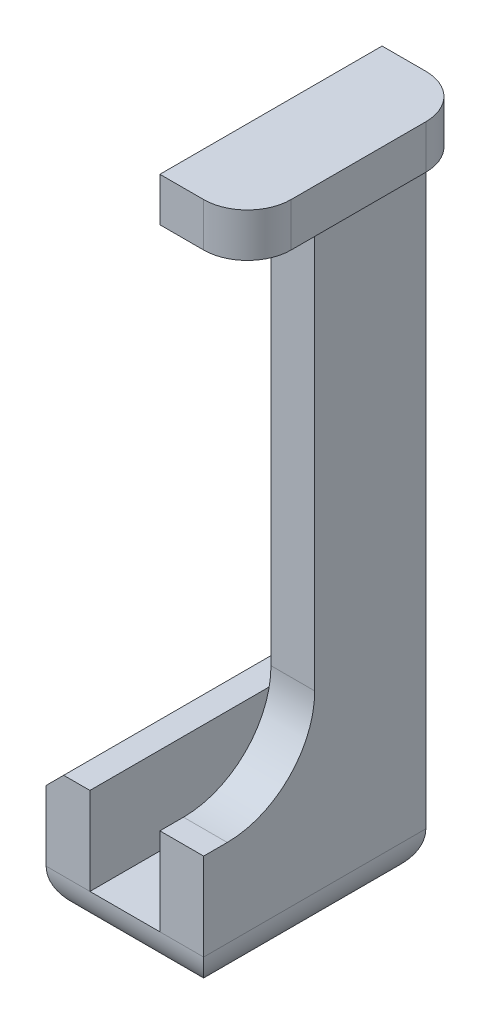
ISO-10303-21;
HEADER;
FILE_DESCRIPTION(('STEP AP214'),'2;1');
FILE_NAME('part.step','',(''),(''),'','','');
FILE_SCHEMA(('AUTOMOTIVE_DESIGN { 1 0 10303 214 1 1 1 1 }'));
ENDSEC;
DATA;
#1=APPLICATION_CONTEXT('core data for automotive mechanical design processes');
#2=APPLICATION_PROTOCOL_DEFINITION('international standard','automotive_design',2000,#1);
#3=PRODUCT_CONTEXT('',#1,'mechanical');
#4=PRODUCT('Part','Part','',(#3));
#5=PRODUCT_RELATED_PRODUCT_CATEGORY('part','',(#4));
#6=PRODUCT_DEFINITION_FORMATION('','',#4);
#7=PRODUCT_DEFINITION_CONTEXT('part definition',#1,'design');
#8=PRODUCT_DEFINITION('design','',#6,#7);
#9=PRODUCT_DEFINITION_SHAPE('','',#8);
#10=(LENGTH_UNIT() NAMED_UNIT(*) SI_UNIT(.MILLI.,.METRE.));
#11=(NAMED_UNIT(*) PLANE_ANGLE_UNIT() SI_UNIT($,.RADIAN.));
#12=(NAMED_UNIT(*) SI_UNIT($,.STERADIAN.) SOLID_ANGLE_UNIT());
#13=UNCERTAINTY_MEASURE_WITH_UNIT(LENGTH_MEASURE(1.E-05),#10,'distance_accuracy_value','');
#14=(GEOMETRIC_REPRESENTATION_CONTEXT(3) GLOBAL_UNCERTAINTY_ASSIGNED_CONTEXT((#13)) GLOBAL_UNIT_ASSIGNED_CONTEXT((#10,
#11,#12)) REPRESENTATION_CONTEXT('',''));
#15=CARTESIAN_POINT('',(0.,0.,0.));
#16=DIRECTION('',(0.,0.,1.));
#17=DIRECTION('',(1.,0.,0.));
#18=AXIS2_PLACEMENT_3D('',#15,#16,#17);
#19=CARTESIAN_POINT('',(0.,0.,0.));
#20=DIRECTION('',(0.,0.,-1.));
#21=DIRECTION('',(-1.,0.,0.));
#22=AXIS2_PLACEMENT_3D('',#19,#20,#21);
#23=PLANE('',#22);
#24=DIRECTION('',(0.,1.,0.));
#25=VECTOR('',#24,1.);
#26=CARTESIAN_POINT('',(5.00000000000002,-5.,0.));
#27=LINE('',#26,#25);
#28=CARTESIAN_POINT('',(5.00000000000002,0.,0.));
#29=VERTEX_POINT('',#28);
#30=CARTESIAN_POINT('',(5.00000000000001,70.,0.));
#31=VERTEX_POINT('',#30);
#32=EDGE_CURVE('E237',#29,#31,#27,.T.);
#33=ORIENTED_EDGE('',*,*,#32,.F.);
#34=DIRECTION('',(1.,0.,0.));
#35=VECTOR('',#34,1.);
#36=CARTESIAN_POINT('',(-13.,0.,0.));
#37=LINE('',#36,#35);
#38=CARTESIAN_POINT('',(0.,0.,0.));
#39=VERTEX_POINT('',#38);
#40=EDGE_CURVE('E290',#29,#39,#37,.F.);
#41=ORIENTED_EDGE('',*,*,#40,.T.);
#42=DIRECTION('',(0.,-1.,0.));
#43=VECTOR('',#42,1.);
#44=CARTESIAN_POINT('',(0.,75.,0.));
#45=LINE('',#44,#43);
#46=CARTESIAN_POINT('',(0.,75.,0.));
#47=VERTEX_POINT('',#46);
#48=EDGE_CURVE('E223',#47,#39,#45,.T.);
#49=ORIENTED_EDGE('',*,*,#48,.F.);
#50=DIRECTION('',(-1.,0.,0.));
#51=VECTOR('',#50,1.);
#52=CARTESIAN_POINT('',(10.,75.,0.));
#53=LINE('',#52,#51);
#54=CARTESIAN_POINT('',(5.00000000000001,75.,0.));
#55=VERTEX_POINT('',#54);
#56=EDGE_CURVE('E185',#55,#47,#53,.T.);
#57=ORIENTED_EDGE('',*,*,#56,.F.);
#58=DIRECTION('',(0.,1.,0.));
#59=VECTOR('',#58,1.);
#60=CARTESIAN_POINT('',(5.00000000000001,70.,0.));
#61=LINE('',#60,#59);
#62=EDGE_CURVE('E285',#55,#31,#61,.F.);
#63=ORIENTED_EDGE('',*,*,#62,.T.);
#64=EDGE_LOOP('',(#33,#41,#49,#57,#63));
#65=FACE_BOUND('',#64,.T.);
#66=ADVANCED_FACE('F33',(#65),#23,.T.);
#67=CARTESIAN_POINT('',(0.,0.,25.4));
#68=DIRECTION('',(0.,0.,1.));
#69=DIRECTION('',(1.,0.,0.));
#70=AXIS2_PLACEMENT_3D('',#67,#68,#69);
#71=PLANE('',#70);
#72=DIRECTION('',(-1.,0.,0.));
#73=VECTOR('',#72,1.);
#74=CARTESIAN_POINT('',(0.,9.99999999999999,25.4));
#75=LINE('',#74,#73);
#76=CARTESIAN_POINT('',(-8.,10.,25.4));
#77=VERTEX_POINT('',#76);
#78=CARTESIAN_POINT('',(-11.,10.,25.4));
#79=VERTEX_POINT('',#78);
#80=EDGE_CURVE('E211',#77,#79,#75,.T.);
#81=ORIENTED_EDGE('',*,*,#80,.T.);
#82=DIRECTION('',(0.70710678118655,0.707106781186545,0.));
#83=VECTOR('',#82,1.);
#84=CARTESIAN_POINT('',(-10.5,10.5,25.4));
#85=LINE('',#84,#83);
#86=CARTESIAN_POINT('',(-13.,8.,25.4));
#87=VERTEX_POINT('',#86);
#88=EDGE_CURVE('E11',#79,#87,#85,.F.);
#89=ORIENTED_EDGE('',*,*,#88,.T.);
#90=DIRECTION('',(0.,-1.,0.));
#91=VECTOR('',#90,1.);
#92=CARTESIAN_POINT('',(-13.,0.,25.4));
#93=LINE('',#92,#91);
#94=CARTESIAN_POINT('',(-13.,0.,25.4));
#95=VERTEX_POINT('',#94);
#96=EDGE_CURVE('E213',#87,#95,#93,.T.);
#97=ORIENTED_EDGE('',*,*,#96,.T.);
#98=DIRECTION('',(1.,0.,0.));
#99=VECTOR('',#98,1.);
#100=CARTESIAN_POINT('',(5.00000000000002,0.,25.4));
#101=LINE('',#100,#99);
#102=CARTESIAN_POINT('',(-8.,0.,25.4));
#103=VERTEX_POINT('',#102);
#104=EDGE_CURVE('E281',#95,#103,#101,.T.);
#105=ORIENTED_EDGE('',*,*,#104,.T.);
#106=DIRECTION('',(0.,1.,0.));
#107=VECTOR('',#106,1.);
#108=CARTESIAN_POINT('',(-8.,0.,25.4));
#109=LINE('',#108,#107);
#110=EDGE_CURVE('E208',#103,#77,#109,.T.);
#111=ORIENTED_EDGE('',*,*,#110,.T.);
#112=EDGE_LOOP('',(#81,#89,#97,#105,#111));
#113=FACE_BOUND('',#112,.T.);
#114=ADVANCED_FACE('F363',(#113),#71,.T.);
#115=CARTESIAN_POINT('',(0.,75.,12.7));
#116=DIRECTION('',(1.,0.,0.));
#117=DIRECTION('',(0.,1.,0.));
#118=AXIS2_PLACEMENT_3D('',#115,#116,#117);
#119=PLANE('',#118);
#120=ORIENTED_EDGE('',*,*,#48,.T.);
#121=DIRECTION('',(0.,0.,-1.));
#122=VECTOR('',#121,1.);
#123=CARTESIAN_POINT('',(0.,0.,12.7));
#124=LINE('',#123,#122);
#125=CARTESIAN_POINT('',(0.,0.,25.4));
#126=VERTEX_POINT('',#125);
#127=EDGE_CURVE('E254',#126,#39,#124,.T.);
#128=ORIENTED_EDGE('',*,*,#127,.F.);
#129=DIRECTION('',(0.,-1.,0.));
#130=VECTOR('',#129,1.);
#131=CARTESIAN_POINT('',(0.,0.,25.4));
#132=LINE('',#131,#130);
#133=CARTESIAN_POINT('',(0.,10.,25.4));
#134=VERTEX_POINT('',#133);
#135=EDGE_CURVE('E202',#134,#126,#132,.T.);
#136=ORIENTED_EDGE('',*,*,#135,.F.);
#137=DIRECTION('',(0.,0.,-1.));
#138=VECTOR('',#137,1.);
#139=CARTESIAN_POINT('',(0.,10.,25.4));
#140=LINE('',#139,#138);
#141=CARTESIAN_POINT('',(0.,10.,22.7));
#142=VERTEX_POINT('',#141);
#143=EDGE_CURVE('E220',#134,#142,#140,.T.);
#144=ORIENTED_EDGE('',*,*,#143,.T.);
#145=CARTESIAN_POINT('',(0.,20.,22.7));
#146=DIRECTION('',(1.,0.,0.));
#147=DIRECTION('',(0.,1.,0.));
#148=AXIS2_PLACEMENT_3D('',#145,#146,#147);
#149=CIRCLE('',#148,10.);
#150=CARTESIAN_POINT('',(0.,20.,12.7));
#151=VERTEX_POINT('',#150);
#152=EDGE_CURVE('E264',#142,#151,#149,.T.);
#153=ORIENTED_EDGE('',*,*,#152,.T.);
#154=DIRECTION('',(0.,-1.,0.));
#155=VECTOR('',#154,1.);
#156=CARTESIAN_POINT('',(0.,75.,12.7));
#157=LINE('',#156,#155);
#158=CARTESIAN_POINT('',(0.,65.,12.7));
#159=VERTEX_POINT('',#158);
#160=EDGE_CURVE('E224',#159,#151,#157,.T.);
#161=ORIENTED_EDGE('',*,*,#160,.F.);
#162=CARTESIAN_POINT('',(0.,65.,17.7));
#163=DIRECTION('',(1.,0.,0.));
#164=DIRECTION('',(0.,1.,0.));
#165=AXIS2_PLACEMENT_3D('',#162,#163,#164);
#166=CIRCLE('',#165,5.);
#167=CARTESIAN_POINT('',(0.,70.,17.7));
#168=VERTEX_POINT('',#167);
#169=EDGE_CURVE('E312',#159,#168,#166,.T.);
#170=ORIENTED_EDGE('',*,*,#169,.T.);
#171=DIRECTION('',(0.,0.,-1.));
#172=VECTOR('',#171,1.);
#173=CARTESIAN_POINT('',(0.,70.,25.4));
#174=LINE('',#173,#172);
#175=CARTESIAN_POINT('',(0.,70.,25.4));
#176=VERTEX_POINT('',#175);
#177=EDGE_CURVE('E194',#176,#168,#174,.T.);
#178=ORIENTED_EDGE('',*,*,#177,.F.);
#179=DIRECTION('',(0.,-1.,0.));
#180=VECTOR('',#179,1.);
#181=CARTESIAN_POINT('',(0.,0.,25.4));
#182=LINE('',#181,#180);
#183=CARTESIAN_POINT('',(0.,75.,25.4));
#184=VERTEX_POINT('',#183);
#185=EDGE_CURVE('E173',#184,#176,#182,.T.);
#186=ORIENTED_EDGE('',*,*,#185,.F.);
#187=DIRECTION('',(0.,0.,-1.));
#188=VECTOR('',#187,1.);
#189=CARTESIAN_POINT('',(0.,75.,12.7));
#190=LINE('',#189,#188);
#191=EDGE_CURVE('E181',#184,#47,#190,.T.);
#192=ORIENTED_EDGE('',*,*,#191,.T.);
#193=EDGE_LOOP('',(#120,#128,#136,#144,#153,#161,#170,#178,#186,#192));
#194=FACE_BOUND('',#193,.T.);
#195=ADVANCED_FACE('F192',(#194),#119,.F.);
#196=CARTESIAN_POINT('',(0.,0.,12.7));
#197=DIRECTION('',(0.,-1.,0.));
#198=DIRECTION('',(0.,0.,-1.));
#199=AXIS2_PLACEMENT_3D('',#196,#197,#198);
#200=PLANE('',#199);
#201=DIRECTION('',(-1.,0.,0.));
#202=VECTOR('',#201,1.);
#203=CARTESIAN_POINT('',(0.,0.,0.));
#204=LINE('',#203,#202);
#205=CARTESIAN_POINT('',(-8.,0.,0.));
#206=VERTEX_POINT('',#205);
#207=EDGE_CURVE('E229',#39,#206,#204,.T.);
#208=ORIENTED_EDGE('',*,*,#207,.T.);
#209=DIRECTION('',(0.,0.,-1.));
#210=VECTOR('',#209,1.);
#211=CARTESIAN_POINT('',(-8.,0.,12.7));
#212=LINE('',#211,#210);
#213=EDGE_CURVE('E251',#103,#206,#212,.T.);
#214=ORIENTED_EDGE('',*,*,#213,.F.);
#215=DIRECTION('',(-1.,0.,0.));
#216=VECTOR('',#215,1.);
#217=CARTESIAN_POINT('',(0.,0.,25.4));
#218=LINE('',#217,#216);
#219=EDGE_CURVE('E205',#126,#103,#218,.T.);
#220=ORIENTED_EDGE('',*,*,#219,.F.);
#221=ORIENTED_EDGE('',*,*,#127,.T.);
#222=EDGE_LOOP('',(#208,#214,#220,#221));
#223=FACE_BOUND('',#222,.T.);
#224=ADVANCED_FACE('F366',(#223),#200,.F.);
#225=CARTESIAN_POINT('',(-8.,0.,12.7));
#226=DIRECTION('',(-1.,0.,0.));
#227=DIRECTION('',(0.,0.,1.));
#228=AXIS2_PLACEMENT_3D('',#225,#226,#227);
#229=PLANE('',#228);
#230=DIRECTION('',(0.,1.,0.));
#231=VECTOR('',#230,1.);
#232=CARTESIAN_POINT('',(-8.,0.,0.));
#233=LINE('',#232,#231);
#234=CARTESIAN_POINT('',(-8.,10.,0.));
#235=VERTEX_POINT('',#234);
#236=EDGE_CURVE('E231',#206,#235,#233,.T.);
#237=ORIENTED_EDGE('',*,*,#236,.T.);
#238=DIRECTION('',(0.,0.,-1.));
#239=VECTOR('',#238,1.);
#240=CARTESIAN_POINT('',(-8.,10.,12.7));
#241=LINE('',#240,#239);
#242=EDGE_CURVE('E248',#77,#235,#241,.T.);
#243=ORIENTED_EDGE('',*,*,#242,.F.);
#244=ORIENTED_EDGE('',*,*,#110,.F.);
#245=ORIENTED_EDGE('',*,*,#213,.T.);
#246=EDGE_LOOP('',(#237,#243,#244,#245));
#247=FACE_BOUND('',#246,.T.);
#248=ADVANCED_FACE('F368',(#247),#229,.F.);
#249=CARTESIAN_POINT('',(-8.,10.,12.7));
#250=DIRECTION('',(0.,-1.,0.));
#251=DIRECTION('',(1.,0.,0.));
#252=AXIS2_PLACEMENT_3D('',#249,#250,#251);
#253=PLANE('',#252);
#254=DIRECTION('',(-1.,0.,0.));
#255=VECTOR('',#254,1.);
#256=CARTESIAN_POINT('',(-8.,10.,0.));
#257=LINE('',#256,#255);
#258=CARTESIAN_POINT('',(-11.,10.,0.));
#259=VERTEX_POINT('',#258);
#260=EDGE_CURVE('E233',#235,#259,#257,.T.);
#261=ORIENTED_EDGE('',*,*,#260,.T.);
#262=DIRECTION('',(0.,0.,1.));
#263=VECTOR('',#262,1.);
#264=CARTESIAN_POINT('',(-11.,10.,12.7));
#265=LINE('',#264,#263);
#266=EDGE_CURVE('E41',#259,#79,#265,.T.);
#267=ORIENTED_EDGE('',*,*,#266,.T.);
#268=ORIENTED_EDGE('',*,*,#80,.F.);
#269=ORIENTED_EDGE('',*,*,#242,.T.);
#270=EDGE_LOOP('',(#261,#267,#268,#269));
#271=FACE_BOUND('',#270,.T.);
#272=ADVANCED_FACE('F369',(#271),#253,.F.);
#273=CARTESIAN_POINT('',(-13.,10.,12.7));
#274=DIRECTION('',(1.,0.,0.));
#275=DIRECTION('',(0.,1.,0.));
#276=AXIS2_PLACEMENT_3D('',#273,#274,#275);
#277=PLANE('',#276);
#278=ORIENTED_EDGE('',*,*,#96,.F.);
#279=DIRECTION('',(0.,0.,-1.));
#280=VECTOR('',#279,1.);
#281=CARTESIAN_POINT('',(-13.,8.,12.7));
#282=LINE('',#281,#280);
#283=CARTESIAN_POINT('',(-13.,8.,0.));
#284=VERTEX_POINT('',#283);
#285=EDGE_CURVE('E316',#87,#284,#282,.T.);
#286=ORIENTED_EDGE('',*,*,#285,.T.);
#287=DIRECTION('',(0.,-1.,0.));
#288=VECTOR('',#287,1.);
#289=CARTESIAN_POINT('',(-13.,10.,0.));
#290=LINE('',#289,#288);
#291=CARTESIAN_POINT('',(-13.,0.,0.));
#292=VERTEX_POINT('',#291);
#293=EDGE_CURVE('E235',#284,#292,#290,.T.);
#294=ORIENTED_EDGE('',*,*,#293,.T.);
#295=DIRECTION('',(0.,0.,-1.));
#296=VECTOR('',#295,1.);
#297=CARTESIAN_POINT('',(-13.,0.,12.7));
#298=LINE('',#297,#296);
#299=EDGE_CURVE('E276',#292,#95,#298,.F.);
#300=ORIENTED_EDGE('',*,*,#299,.T.);
#301=EDGE_LOOP('',(#278,#286,#294,#300));
#302=FACE_BOUND('',#301,.T.);
#303=ADVANCED_FACE('F333',(#302),#277,.F.);
#304=CARTESIAN_POINT('',(-13.,-5.,12.7));
#305=DIRECTION('',(0.,1.,0.));
#306=DIRECTION('',(-1.,0.,0.));
#307=AXIS2_PLACEMENT_3D('',#304,#305,#306);
#308=PLANE('',#307);
#309=DIRECTION('',(1.,0.,0.));
#310=VECTOR('',#309,1.);
#311=CARTESIAN_POINT('',(-13.,-5.,20.4));
#312=LINE('',#311,#310);
#313=CARTESIAN_POINT('',(0.,-5.,20.4));
#314=VERTEX_POINT('',#313);
#315=CARTESIAN_POINT('',(-8.,-5.,20.4));
#316=VERTEX_POINT('',#315);
#317=EDGE_CURVE('E271',#314,#316,#312,.F.);
#318=ORIENTED_EDGE('',*,*,#317,.T.);
#319=DIRECTION('',(0.,0.,-1.));
#320=VECTOR('',#319,1.);
#321=CARTESIAN_POINT('',(-8.,-5.,12.7));
#322=LINE('',#321,#320);
#323=CARTESIAN_POINT('',(-8.,-5.,5.));
#324=VERTEX_POINT('',#323);
#325=EDGE_CURVE('E273',#316,#324,#322,.T.);
#326=ORIENTED_EDGE('',*,*,#325,.T.);
#327=DIRECTION('',(1.,0.,0.));
#328=VECTOR('',#327,1.);
#329=CARTESIAN_POINT('',(5.00000000000002,-5.,5.));
#330=LINE('',#329,#328);
#331=CARTESIAN_POINT('',(0.,-5.,5.));
#332=VERTEX_POINT('',#331);
#333=EDGE_CURVE('E267',#324,#332,#330,.T.);
#334=ORIENTED_EDGE('',*,*,#333,.T.);
#335=DIRECTION('',(0.,0.,-1.));
#336=VECTOR('',#335,1.);
#337=CARTESIAN_POINT('',(0.,-5.,12.7));
#338=LINE('',#337,#336);
#339=EDGE_CURVE('E269',#332,#314,#338,.F.);
#340=ORIENTED_EDGE('',*,*,#339,.T.);
#341=EDGE_LOOP('',(#318,#326,#334,#340));
#342=FACE_BOUND('',#341,.T.);
#343=ADVANCED_FACE('F354',(#342),#308,.F.);
#344=CARTESIAN_POINT('',(5.00000000000002,-5.,12.7));
#345=DIRECTION('',(-1.,0.,0.));
#346=DIRECTION('',(0.,-1.,0.));
#347=AXIS2_PLACEMENT_3D('',#344,#345,#346);
#348=PLANE('',#347);
#349=DIRECTION('',(0.,1.,0.));
#350=VECTOR('',#349,1.);
#351=CARTESIAN_POINT('',(5.00000000000002,0.,25.4));
#352=LINE('',#351,#350);
#353=CARTESIAN_POINT('',(5.00000000000002,0.,25.4));
#354=VERTEX_POINT('',#353);
#355=CARTESIAN_POINT('',(5.00000000000002,10.,25.4));
#356=VERTEX_POINT('',#355);
#357=EDGE_CURVE('E215',#354,#356,#352,.T.);
#358=ORIENTED_EDGE('',*,*,#357,.F.);
#359=DIRECTION('',(0.,0.,-1.));
#360=VECTOR('',#359,1.);
#361=CARTESIAN_POINT('',(5.00000000000002,0.,12.7));
#362=LINE('',#361,#360);
#363=EDGE_CURVE('E283',#354,#29,#362,.T.);
#364=ORIENTED_EDGE('',*,*,#363,.T.);
#365=ORIENTED_EDGE('',*,*,#32,.T.);
#366=DIRECTION('',(0.,0.,-1.));
#367=VECTOR('',#366,1.);
#368=CARTESIAN_POINT('',(5.00000000000001,70.,12.7));
#369=LINE('',#368,#367);
#370=CARTESIAN_POINT('',(5.00000000000001,70.,17.7));
#371=VERTEX_POINT('',#370);
#372=EDGE_CURVE('E245',#371,#31,#369,.T.);
#373=ORIENTED_EDGE('',*,*,#372,.F.);
#374=CARTESIAN_POINT('',(5.00000000000001,65.,17.7));
#375=DIRECTION('',(-1.,0.,0.));
#376=DIRECTION('',(0.,-1.,0.));
#377=AXIS2_PLACEMENT_3D('',#374,#375,#376);
#378=CIRCLE('',#377,5.);
#379=CARTESIAN_POINT('',(5.00000000000001,65.,12.7));
#380=VERTEX_POINT('',#379);
#381=EDGE_CURVE('E314',#371,#380,#378,.T.);
#382=ORIENTED_EDGE('',*,*,#381,.T.);
#383=DIRECTION('',(0.,1.,0.));
#384=VECTOR('',#383,1.);
#385=CARTESIAN_POINT('',(5.00000000000002,-5.,12.7));
#386=LINE('',#385,#384);
#387=CARTESIAN_POINT('',(5.00000000000001,20.,12.7));
#388=VERTEX_POINT('',#387);
#389=EDGE_CURVE('E190',#388,#380,#386,.T.);
#390=ORIENTED_EDGE('',*,*,#389,.F.);
#391=CARTESIAN_POINT('',(5.00000000000001,20.,22.7));
#392=DIRECTION('',(-1.,0.,0.));
#393=DIRECTION('',(0.,-1.,0.));
#394=AXIS2_PLACEMENT_3D('',#391,#392,#393);
#395=CIRCLE('',#394,10.);
#396=CARTESIAN_POINT('',(5.00000000000002,10.,22.7));
#397=VERTEX_POINT('',#396);
#398=EDGE_CURVE('E262',#388,#397,#395,.T.);
#399=ORIENTED_EDGE('',*,*,#398,.T.);
#400=DIRECTION('',(0.,0.,-1.));
#401=VECTOR('',#400,1.);
#402=CARTESIAN_POINT('',(5.00000000000002,10.,25.4));
#403=LINE('',#402,#401);
#404=EDGE_CURVE('E217',#356,#397,#403,.T.);
#405=ORIENTED_EDGE('',*,*,#404,.F.);
#406=EDGE_LOOP('',(#358,#364,#365,#373,#382,#390,#399,#405));
#407=FACE_BOUND('',#406,.T.);
#408=ADVANCED_FACE('F456',(#407),#348,.F.);
#409=CARTESIAN_POINT('',(5.00000000000001,70.,12.7));
#410=DIRECTION('',(0.,1.,0.));
#411=DIRECTION('',(0.,0.,1.));
#412=AXIS2_PLACEMENT_3D('',#409,#410,#411);
#413=PLANE('',#412);
#414=ORIENTED_EDGE('',*,*,#372,.T.);
#415=CARTESIAN_POINT('',(5.00000000000001,70.,5.));
#416=DIRECTION('',(0.,1.,0.));
#417=DIRECTION('',(0.,0.,1.));
#418=AXIS2_PLACEMENT_3D('',#415,#416,#417);
#419=CIRCLE('',#418,5.);
#420=CARTESIAN_POINT('',(10.,70.,5.));
#421=VERTEX_POINT('',#420);
#422=EDGE_CURVE('E306',#31,#421,#419,.F.);
#423=ORIENTED_EDGE('',*,*,#422,.T.);
#424=DIRECTION('',(0.,0.,-1.));
#425=VECTOR('',#424,1.);
#426=CARTESIAN_POINT('',(10.,70.,12.7));
#427=LINE('',#426,#425);
#428=CARTESIAN_POINT('',(10.,70.,20.4));
#429=VERTEX_POINT('',#428);
#430=EDGE_CURVE('E242',#429,#421,#427,.T.);
#431=ORIENTED_EDGE('',*,*,#430,.F.);
#432=CARTESIAN_POINT('',(5.00000000000001,70.,20.4));
#433=DIRECTION('',(0.,1.,0.));
#434=DIRECTION('',(0.,0.,1.));
#435=AXIS2_PLACEMENT_3D('',#432,#433,#434);
#436=CIRCLE('',#435,5.);
#437=CARTESIAN_POINT('',(5.00000000000001,70.,25.4));
#438=VERTEX_POINT('',#437);
#439=EDGE_CURVE('E304',#429,#438,#436,.F.);
#440=ORIENTED_EDGE('',*,*,#439,.T.);
#441=DIRECTION('',(-1.,0.,0.));
#442=VECTOR('',#441,1.);
#443=CARTESIAN_POINT('',(0.,70.,25.4));
#444=LINE('',#443,#442);
#445=EDGE_CURVE('E178',#438,#176,#444,.T.);
#446=ORIENTED_EDGE('',*,*,#445,.T.);
#447=ORIENTED_EDGE('',*,*,#177,.T.);
#448=DIRECTION('',(-1.,0.,0.));
#449=VECTOR('',#448,1.);
#450=CARTESIAN_POINT('',(5.00000000000001,70.,17.7));
#451=LINE('',#450,#449);
#452=EDGE_CURVE('E301',#168,#371,#451,.F.);
#453=ORIENTED_EDGE('',*,*,#452,.T.);
#454=EDGE_LOOP('',(#414,#423,#431,#440,#446,#447,#453));
#455=FACE_BOUND('',#454,.T.);
#456=ADVANCED_FACE('F440',(#455),#413,.F.);
#457=CARTESIAN_POINT('',(10.,70.,12.7));
#458=DIRECTION('',(-1.,0.,0.));
#459=DIRECTION('',(0.,0.,1.));
#460=AXIS2_PLACEMENT_3D('',#457,#458,#459);
#461=PLANE('',#460);
#462=ORIENTED_EDGE('',*,*,#430,.T.);
#463=DIRECTION('',(0.,1.,0.));
#464=VECTOR('',#463,1.);
#465=CARTESIAN_POINT('',(10.,75.,5.));
#466=LINE('',#465,#464);
#467=CARTESIAN_POINT('',(10.,75.,5.));
#468=VERTEX_POINT('',#467);
#469=EDGE_CURVE('E294',#421,#468,#466,.T.);
#470=ORIENTED_EDGE('',*,*,#469,.T.);
#471=DIRECTION('',(0.,0.,-1.));
#472=VECTOR('',#471,1.);
#473=CARTESIAN_POINT('',(10.,75.,12.7));
#474=LINE('',#473,#472);
#475=CARTESIAN_POINT('',(10.,75.,20.4));
#476=VERTEX_POINT('',#475);
#477=EDGE_CURVE('E189',#476,#468,#474,.T.);
#478=ORIENTED_EDGE('',*,*,#477,.F.);
#479=DIRECTION('',(0.,1.,0.));
#480=VECTOR('',#479,1.);
#481=CARTESIAN_POINT('',(10.,70.,20.4));
#482=LINE('',#481,#480);
#483=EDGE_CURVE('E292',#476,#429,#482,.F.);
#484=ORIENTED_EDGE('',*,*,#483,.T.);
#485=EDGE_LOOP('',(#462,#470,#478,#484));
#486=FACE_BOUND('',#485,.T.);
#487=ADVANCED_FACE('F401',(#486),#461,.F.);
#488=CARTESIAN_POINT('',(10.,75.,12.7));
#489=DIRECTION('',(0.,-1.,0.));
#490=DIRECTION('',(0.,0.,-1.));
#491=AXIS2_PLACEMENT_3D('',#488,#489,#490);
#492=PLANE('',#491);
#493=ORIENTED_EDGE('',*,*,#477,.T.);
#494=CARTESIAN_POINT('',(5.00000000000001,75.,5.));
#495=DIRECTION('',(0.,-1.,0.));
#496=DIRECTION('',(0.,0.,-1.));
#497=AXIS2_PLACEMENT_3D('',#494,#495,#496);
#498=CIRCLE('',#497,5.);
#499=EDGE_CURVE('E299',#468,#55,#498,.F.);
#500=ORIENTED_EDGE('',*,*,#499,.T.);
#501=ORIENTED_EDGE('',*,*,#56,.T.);
#502=ORIENTED_EDGE('',*,*,#191,.F.);
#503=DIRECTION('',(-1.,0.,0.));
#504=VECTOR('',#503,1.);
#505=CARTESIAN_POINT('',(0.,75.,25.4));
#506=LINE('',#505,#504);
#507=CARTESIAN_POINT('',(5.00000000000001,75.,25.4));
#508=VERTEX_POINT('',#507);
#509=EDGE_CURVE('E168',#508,#184,#506,.T.);
#510=ORIENTED_EDGE('',*,*,#509,.F.);
#511=CARTESIAN_POINT('',(5.00000000000001,75.,20.4));
#512=DIRECTION('',(0.,-1.,0.));
#513=DIRECTION('',(0.,0.,-1.));
#514=AXIS2_PLACEMENT_3D('',#511,#512,#513);
#515=CIRCLE('',#514,5.);
#516=EDGE_CURVE('E297',#508,#476,#515,.F.);
#517=ORIENTED_EDGE('',*,*,#516,.T.);
#518=EDGE_LOOP('',(#493,#500,#501,#502,#510,#517));
#519=FACE_BOUND('',#518,.T.);
#520=ADVANCED_FACE('F183',(#519),#492,.F.);
#521=CARTESIAN_POINT('',(0.,0.,12.7));
#522=DIRECTION('',(0.,0.,-1.));
#523=DIRECTION('',(-1.,0.,0.));
#524=AXIS2_PLACEMENT_3D('',#521,#522,#523);
#525=PLANE('',#524);
#526=ORIENTED_EDGE('',*,*,#389,.T.);
#527=DIRECTION('',(-1.,0.,0.));
#528=VECTOR('',#527,1.);
#529=CARTESIAN_POINT('',(0.,65.,12.7));
#530=LINE('',#529,#528);
#531=EDGE_CURVE('E309',#380,#159,#530,.T.);
#532=ORIENTED_EDGE('',*,*,#531,.T.);
#533=ORIENTED_EDGE('',*,*,#160,.T.);
#534=DIRECTION('',(1.,0.,0.));
#535=VECTOR('',#534,1.);
#536=CARTESIAN_POINT('',(0.,20.,12.7));
#537=LINE('',#536,#535);
#538=EDGE_CURVE('E257',#151,#388,#537,.T.);
#539=ORIENTED_EDGE('',*,*,#538,.T.);
#540=EDGE_LOOP('',(#526,#532,#533,#539));
#541=FACE_BOUND('',#540,.T.);
#542=ADVANCED_FACE('F390',(#541),#525,.F.);
#543=ORIENTED_EDGE('',*,*,#293,.F.);
#544=DIRECTION('',(-0.70710678118655,-0.707106781186545,0.));
#545=VECTOR('',#544,1.);
#546=CARTESIAN_POINT('',(-10.5,10.5,0.));
#547=LINE('',#546,#545);
#548=EDGE_CURVE('E55',#284,#259,#547,.F.);
#549=ORIENTED_EDGE('',*,*,#548,.T.);
#550=ORIENTED_EDGE('',*,*,#260,.F.);
#551=ORIENTED_EDGE('',*,*,#236,.F.);
#552=DIRECTION('',(1.,0.,0.));
#553=VECTOR('',#552,1.);
#554=CARTESIAN_POINT('',(-13.,0.,0.));
#555=LINE('',#554,#553);
#556=EDGE_CURVE('E287',#206,#292,#555,.F.);
#557=ORIENTED_EDGE('',*,*,#556,.T.);
#558=EDGE_LOOP('',(#543,#549,#550,#551,#557));
#559=FACE_BOUND('',#558,.T.);
#560=ADVANCED_FACE('F336',(#559),#23,.T.);
#561=CARTESIAN_POINT('',(0.,10.,25.4));
#562=DIRECTION('',(0.,1.,0.));
#563=DIRECTION('',(-1.,0.,0.));
#564=AXIS2_PLACEMENT_3D('',#561,#562,#563);
#565=PLANE('',#564);
#566=ORIENTED_EDGE('',*,*,#404,.T.);
#567=DIRECTION('',(1.,0.,0.));
#568=VECTOR('',#567,1.);
#569=CARTESIAN_POINT('',(0.,10.,22.7));
#570=LINE('',#569,#568);
#571=EDGE_CURVE('E260',#397,#142,#570,.F.);
#572=ORIENTED_EDGE('',*,*,#571,.T.);
#573=ORIENTED_EDGE('',*,*,#143,.F.);
#574=DIRECTION('',(1.,0.,0.));
#575=VECTOR('',#574,1.);
#576=CARTESIAN_POINT('',(0.,10.,25.4));
#577=LINE('',#576,#575);
#578=EDGE_CURVE('E196',#134,#356,#577,.T.);
#579=ORIENTED_EDGE('',*,*,#578,.T.);
#580=EDGE_LOOP('',(#566,#572,#573,#579));
#581=FACE_BOUND('',#580,.T.);
#582=ADVANCED_FACE('F389',(#581),#565,.T.);
#583=ORIENTED_EDGE('',*,*,#135,.T.);
#584=DIRECTION('',(1.,0.,0.));
#585=VECTOR('',#584,1.);
#586=CARTESIAN_POINT('',(5.00000000000002,0.,25.4));
#587=LINE('',#586,#585);
#588=EDGE_CURVE('E279',#126,#354,#587,.T.);
#589=ORIENTED_EDGE('',*,*,#588,.T.);
#590=ORIENTED_EDGE('',*,*,#357,.T.);
#591=ORIENTED_EDGE('',*,*,#578,.F.);
#592=EDGE_LOOP('',(#583,#589,#590,#591));
#593=FACE_BOUND('',#592,.T.);
#594=ADVANCED_FACE('F384',(#593),#71,.T.);
#595=CARTESIAN_POINT('',(0.,0.,25.4));
#596=DIRECTION('',(0.,0.,1.));
#597=DIRECTION('',(1.,0.,0.));
#598=AXIS2_PLACEMENT_3D('',#595,#596,#597);
#599=PLANE('',#598);
#600=ORIENTED_EDGE('',*,*,#445,.F.);
#601=DIRECTION('',(0.,1.,0.));
#602=VECTOR('',#601,1.);
#603=CARTESIAN_POINT('',(5.00000000000001,75.,25.4));
#604=LINE('',#603,#602);
#605=EDGE_CURVE('E176',#438,#508,#604,.T.);
#606=ORIENTED_EDGE('',*,*,#605,.T.);
#607=ORIENTED_EDGE('',*,*,#509,.T.);
#608=ORIENTED_EDGE('',*,*,#185,.T.);
#609=EDGE_LOOP('',(#600,#606,#607,#608));
#610=FACE_BOUND('',#609,.T.);
#611=ADVANCED_FACE('F171',(#610),#599,.T.);
#612=CARTESIAN_POINT('',(0.,20.,22.7));
#613=DIRECTION('',(1.,0.,0.));
#614=DIRECTION('',(0.,1.,0.));
#615=AXIS2_PLACEMENT_3D('',#612,#613,#614);
#616=CYLINDRICAL_SURFACE('',#615,10.);
#617=ORIENTED_EDGE('',*,*,#152,.F.);
#618=ORIENTED_EDGE('',*,*,#571,.F.);
#619=ORIENTED_EDGE('',*,*,#398,.F.);
#620=ORIENTED_EDGE('',*,*,#538,.F.);
#621=EDGE_LOOP('',(#617,#618,#619,#620));
#622=FACE_BOUND('',#621,.T.);
#623=ADVANCED_FACE('F406',(#622),#616,.F.);
#624=CARTESIAN_POINT('',(0.,0.,12.7));
#625=DIRECTION('',(0.,0.,-1.));
#626=DIRECTION('',(-1.,0.,0.));
#627=AXIS2_PLACEMENT_3D('',#624,#625,#626);
#628=CYLINDRICAL_SURFACE('',#627,5.);
#629=CARTESIAN_POINT('',(0.,0.,5.));
#630=DIRECTION('',(-0.707106781186547,0.,-0.707106781186547));
#631=DIRECTION('',(-0.707106781186547,0.,0.707106781186547));
#632=AXIS2_PLACEMENT_3D('',#629,#630,#631);
#633=ELLIPSE('',#632,7.07106781186547,5.);
#634=EDGE_CURVE('E322',#29,#332,#633,.T.);
#635=ORIENTED_EDGE('',*,*,#634,.F.);
#636=ORIENTED_EDGE('',*,*,#363,.F.);
#637=CARTESIAN_POINT('',(0.,0.,20.4));
#638=DIRECTION('',(0.707106781186547,0.,-0.707106781186547));
#639=DIRECTION('',(-0.707106781186547,0.,-0.707106781186547));
#640=AXIS2_PLACEMENT_3D('',#637,#638,#639);
#641=ELLIPSE('',#640,7.07106781186547,5.);
#642=EDGE_CURVE('E325',#314,#354,#641,.F.);
#643=ORIENTED_EDGE('',*,*,#642,.F.);
#644=ORIENTED_EDGE('',*,*,#339,.F.);
#645=EDGE_LOOP('',(#635,#636,#643,#644));
#646=FACE_BOUND('',#645,.T.);
#647=ADVANCED_FACE('F410',(#646),#628,.T.);
#648=CARTESIAN_POINT('',(0.,0.,20.4));
#649=DIRECTION('',(-1.,0.,0.));
#650=DIRECTION('',(0.,-1.,0.));
#651=AXIS2_PLACEMENT_3D('',#648,#649,#650);
#652=CYLINDRICAL_SURFACE('',#651,5.);
#653=ORIENTED_EDGE('',*,*,#219,.T.);
#654=ORIENTED_EDGE('',*,*,#104,.F.);
#655=CARTESIAN_POINT('',(-8.,0.,20.4));
#656=DIRECTION('',(-0.707106781186547,0.,-0.707106781186547));
#657=DIRECTION('',(-0.707106781186547,0.,0.707106781186547));
#658=AXIS2_PLACEMENT_3D('',#655,#656,#657);
#659=ELLIPSE('',#658,7.07106781186547,5.);
#660=EDGE_CURVE('E319',#316,#95,#659,.T.);
#661=ORIENTED_EDGE('',*,*,#660,.F.);
#662=ORIENTED_EDGE('',*,*,#317,.F.);
#663=ORIENTED_EDGE('',*,*,#642,.T.);
#664=ORIENTED_EDGE('',*,*,#588,.F.);
#665=EDGE_LOOP('',(#653,#654,#661,#662,#663,#664));
#666=FACE_BOUND('',#665,.T.);
#667=ADVANCED_FACE('F358',(#666),#652,.T.);
#668=CARTESIAN_POINT('',(-13.,0.,5.));
#669=DIRECTION('',(-1.,0.,0.));
#670=DIRECTION('',(0.,-1.,0.));
#671=AXIS2_PLACEMENT_3D('',#668,#669,#670);
#672=CYLINDRICAL_SURFACE('',#671,5.);
#673=ORIENTED_EDGE('',*,*,#634,.T.);
#674=ORIENTED_EDGE('',*,*,#333,.F.);
#675=CARTESIAN_POINT('',(-8.,0.,5.));
#676=DIRECTION('',(-0.707106781186547,0.,0.707106781186547));
#677=DIRECTION('',(-0.707106781186547,0.,-0.707106781186547));
#678=AXIS2_PLACEMENT_3D('',#675,#676,#677);
#679=ELLIPSE('',#678,7.07106781186547,5.);
#680=EDGE_CURVE('E317',#292,#324,#679,.T.);
#681=ORIENTED_EDGE('',*,*,#680,.F.);
#682=ORIENTED_EDGE('',*,*,#556,.F.);
#683=ORIENTED_EDGE('',*,*,#207,.F.);
#684=ORIENTED_EDGE('',*,*,#40,.F.);
#685=EDGE_LOOP('',(#673,#674,#681,#682,#683,#684));
#686=FACE_BOUND('',#685,.T.);
#687=ADVANCED_FACE('F349',(#686),#672,.T.);
#688=CARTESIAN_POINT('',(-8.,0.,12.7));
#689=DIRECTION('',(0.,0.,-1.));
#690=DIRECTION('',(-1.,0.,0.));
#691=AXIS2_PLACEMENT_3D('',#688,#689,#690);
#692=CYLINDRICAL_SURFACE('',#691,5.);
#693=ORIENTED_EDGE('',*,*,#660,.T.);
#694=ORIENTED_EDGE('',*,*,#299,.F.);
#695=ORIENTED_EDGE('',*,*,#680,.T.);
#696=ORIENTED_EDGE('',*,*,#325,.F.);
#697=EDGE_LOOP('',(#693,#694,#695,#696));
#698=FACE_BOUND('',#697,.T.);
#699=ADVANCED_FACE('F344',(#698),#692,.T.);
#700=CARTESIAN_POINT('',(5.00000000000001,70.,5.));
#701=DIRECTION('',(0.,-1.,0.));
#702=DIRECTION('',(0.,0.,-1.));
#703=AXIS2_PLACEMENT_3D('',#700,#701,#702);
#704=CYLINDRICAL_SURFACE('',#703,5.);
#705=ORIENTED_EDGE('',*,*,#422,.F.);
#706=ORIENTED_EDGE('',*,*,#62,.F.);
#707=ORIENTED_EDGE('',*,*,#499,.F.);
#708=ORIENTED_EDGE('',*,*,#469,.F.);
#709=EDGE_LOOP('',(#705,#706,#707,#708));
#710=FACE_BOUND('',#709,.T.);
#711=ADVANCED_FACE('F424',(#710),#704,.T.);
#712=CARTESIAN_POINT('',(5.00000000000001,0.,20.4));
#713=DIRECTION('',(0.,-1.,0.));
#714=DIRECTION('',(0.,0.,-1.));
#715=AXIS2_PLACEMENT_3D('',#712,#713,#714);
#716=CYLINDRICAL_SURFACE('',#715,5.);
#717=ORIENTED_EDGE('',*,*,#439,.F.);
#718=ORIENTED_EDGE('',*,*,#483,.F.);
#719=ORIENTED_EDGE('',*,*,#516,.F.);
#720=ORIENTED_EDGE('',*,*,#605,.F.);
#721=EDGE_LOOP('',(#717,#718,#719,#720));
#722=FACE_BOUND('',#721,.T.);
#723=ADVANCED_FACE('F375',(#722),#716,.T.);
#724=CARTESIAN_POINT('',(0.,65.,17.7));
#725=DIRECTION('',(1.,0.,0.));
#726=DIRECTION('',(0.,0.,-1.));
#727=AXIS2_PLACEMENT_3D('',#724,#725,#726);
#728=CYLINDRICAL_SURFACE('',#727,5.);
#729=ORIENTED_EDGE('',*,*,#381,.F.);
#730=ORIENTED_EDGE('',*,*,#452,.F.);
#731=ORIENTED_EDGE('',*,*,#169,.F.);
#732=ORIENTED_EDGE('',*,*,#531,.F.);
#733=EDGE_LOOP('',(#729,#730,#731,#732));
#734=FACE_BOUND('',#733,.T.);
#735=ADVANCED_FACE('F371',(#734),#728,.F.);
#736=CARTESIAN_POINT('',(-13.,8.,12.7));
#737=DIRECTION('',(0.707106781186545,-0.70710678118655,0.));
#738=DIRECTION('',(0.,0.,-1.));
#739=AXIS2_PLACEMENT_3D('',#736,#737,#738);
#740=PLANE('',#739);
#741=ORIENTED_EDGE('',*,*,#88,.F.);
#742=ORIENTED_EDGE('',*,*,#266,.F.);
#743=ORIENTED_EDGE('',*,*,#548,.F.);
#744=ORIENTED_EDGE('',*,*,#285,.F.);
#745=EDGE_LOOP('',(#741,#742,#743,#744));
#746=FACE_BOUND('',#745,.T.);
#747=ADVANCED_FACE('F35',(#746),#740,.F.);
#748=CLOSED_SHELL('',(#66,#114,#195,#224,#248,#272,#303,#343,#408,#456,#487,#520,#542,#560,#582,
#594,#611,#623,#647,#667,#687,#699,#711,#723,#735,#747));
#749=MANIFOLD_SOLID_BREP('B2',#748);
#750=ADVANCED_BREP_SHAPE_REPRESENTATION('',(#18,#749),#14);
#751=SHAPE_DEFINITION_REPRESENTATION(#9,#750);
ENDSEC;
END-ISO-10303-21;
